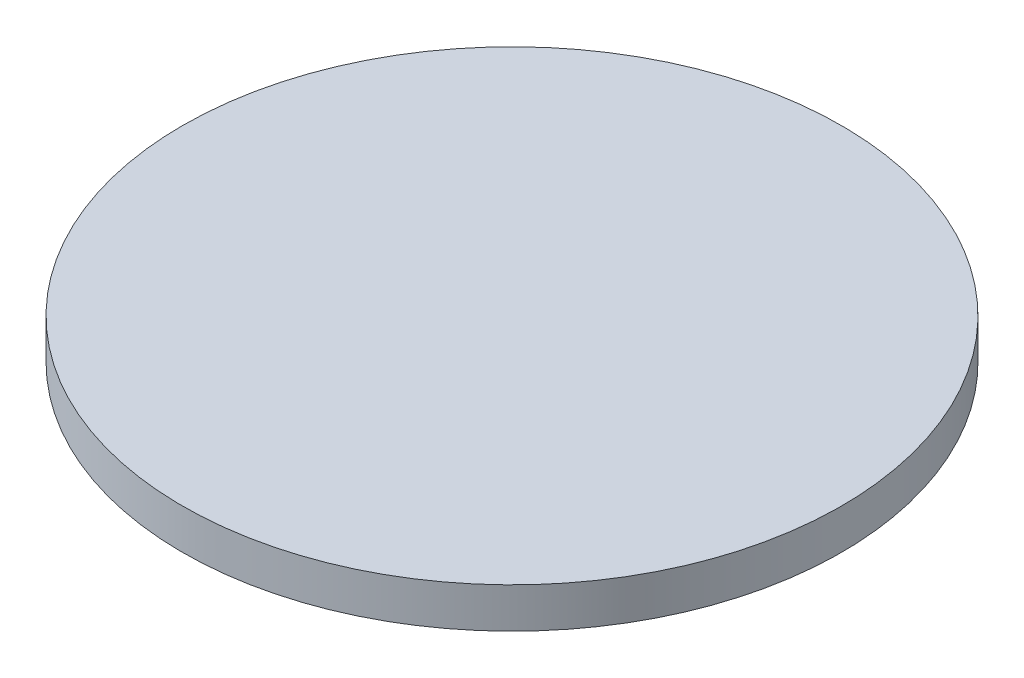
ISO-10303-21;
HEADER;
FILE_DESCRIPTION(('STEP AP214'),'2;1');
FILE_NAME('part.step','',(''),(''),'','','');
FILE_SCHEMA(('AUTOMOTIVE_DESIGN { 1 0 10303 214 1 1 1 1 }'));
ENDSEC;
DATA;
#1=APPLICATION_CONTEXT('core data for automotive mechanical design processes');
#2=APPLICATION_PROTOCOL_DEFINITION('international standard','automotive_design',2000,#1);
#3=PRODUCT_CONTEXT('',#1,'mechanical');
#4=PRODUCT('Part','Part','',(#3));
#5=PRODUCT_RELATED_PRODUCT_CATEGORY('part','',(#4));
#6=PRODUCT_DEFINITION_FORMATION('','',#4);
#7=PRODUCT_DEFINITION_CONTEXT('part definition',#1,'design');
#8=PRODUCT_DEFINITION('design','',#6,#7);
#9=PRODUCT_DEFINITION_SHAPE('','',#8);
#10=(LENGTH_UNIT() NAMED_UNIT(*) SI_UNIT(.MILLI.,.METRE.));
#11=(NAMED_UNIT(*) PLANE_ANGLE_UNIT() SI_UNIT($,.RADIAN.));
#12=(NAMED_UNIT(*) SI_UNIT($,.STERADIAN.) SOLID_ANGLE_UNIT());
#13=UNCERTAINTY_MEASURE_WITH_UNIT(LENGTH_MEASURE(1.E-05),#10,'distance_accuracy_value','');
#14=(GEOMETRIC_REPRESENTATION_CONTEXT(3) GLOBAL_UNCERTAINTY_ASSIGNED_CONTEXT((#13)) GLOBAL_UNIT_ASSIGNED_CONTEXT((#10,
#11,#12)) REPRESENTATION_CONTEXT('',''));
#15=CARTESIAN_POINT('',(0.,0.,0.));
#16=DIRECTION('',(0.,0.,1.));
#17=DIRECTION('',(1.,0.,0.));
#18=AXIS2_PLACEMENT_3D('',#15,#16,#17);
#19=CARTESIAN_POINT('',(-6.37017451861787,12.5735140888963,7.03200943644333));
#20=CARTESIAN_POINT('',(-6.37017451861787,12.5735140888963,6.52052571334626));
#21=CARTESIAN_POINT('',(-6.26942101925352,12.5735140888963,5.49755826715213));
#22=CARTESIAN_POINT('',(-5.82183812282996,12.5735140888963,4.02207519576666));
#23=CARTESIAN_POINT('',(-5.09500293873155,12.5735140888963,2.66226220925982));
#24=CARTESIAN_POINT('',(-4.11684733546933,12.5735140888963,1.47037615811117));
#25=CARTESIAN_POINT('',(-2.92496128432067,12.5735140888963,0.492220554848945));
#26=CARTESIAN_POINT('',(-1.56514829781384,12.5735140888963,-0.234614629249463));
#27=CARTESIAN_POINT('',(-0.089665226428362,12.5735140888963,-0.682197525673021));
#28=CARTESIAN_POINT('',(1.44478594286284,12.5735140888963,-0.833327774719554));
#29=CARTESIAN_POINT('',(2.97923711215404,12.5735140888963,-0.68219752567302));
#30=CARTESIAN_POINT('',(4.45472018353952,12.5735140888963,-0.234614629249463));
#31=CARTESIAN_POINT('',(5.81453317004635,12.5735140888963,0.492220554848944));
#32=CARTESIAN_POINT('',(7.00641922119501,12.5735140888963,1.47037615811117));
#33=CARTESIAN_POINT('',(7.98457482445723,12.5735140888963,2.66226220925982));
#34=CARTESIAN_POINT('',(8.71141000855564,12.5735140888963,4.02207519576666));
#35=CARTESIAN_POINT('',(9.1589929049792,12.5735140888963,5.49755826715213));
#36=CARTESIAN_POINT('',(9.31012315402573,12.5735140888963,7.03200943644333));
#37=CARTESIAN_POINT('',(9.1589929049792,12.5735140888963,8.56646060573454));
#38=CARTESIAN_POINT('',(8.71141000855564,12.5735140888963,10.04194367712));
#39=CARTESIAN_POINT('',(7.98457482445723,12.5735140888963,11.4017566636269));
#40=CARTESIAN_POINT('',(7.00641922119501,12.5735140888963,12.5936427147755));
#41=CARTESIAN_POINT('',(5.81453317004636,12.5735140888963,13.5717983180377));
#42=CARTESIAN_POINT('',(4.45472018353952,12.5735140888963,14.2986335021361));
#43=CARTESIAN_POINT('',(2.97923711215405,12.5735140888963,14.7462163985597));
#44=CARTESIAN_POINT('',(1.44478594286284,12.5735140888963,14.8973466476062));
#45=CARTESIAN_POINT('',(-0.0896652264283681,12.5735140888963,14.7462163985597));
#46=CARTESIAN_POINT('',(-1.56514829781383,12.5735140888963,14.2986335021361));
#47=CARTESIAN_POINT('',(-2.92496128432067,12.5735140888963,13.5717983180377));
#48=CARTESIAN_POINT('',(-4.11684733546933,12.5735140888963,12.5936427147755));
#49=CARTESIAN_POINT('',(-5.09500293873155,12.5735140888963,11.4017566636268));
#50=CARTESIAN_POINT('',(-5.82183812282996,12.5735140888963,10.04194367712));
#51=CARTESIAN_POINT('',(-6.26942101925351,12.5735140888963,8.56646060573455));
#52=CARTESIAN_POINT('',(-6.37017451861787,12.5735140888963,7.5434931595404));
#53=CARTESIAN_POINT('',(-6.37017451861787,12.5735140888963,7.03200943644333));
#54=B_SPLINE_CURVE_WITH_KNOTS('',3,(#19,#20,#21,#22,#23,#24,#25,#26,#27,#28,#29,#30,#31,#32,#33,
#34,#35,#36,#37,#38,#39,#40,#41,#42,#43,#44,#45,#46,#47,#48,#49,#50,#51,#52,#53),.UNSPECIFIED.,
.T.,.F.,(4,1,1,1,1,1,1,1,1,1,1,1,1,1,1,1,1,1,1,1,1,1,1,1,1,1,1,1,1,1,1,1,4),(0.,0.03125,0.0625,
0.09375,0.125,0.15625,0.1875,0.21875,0.25,0.28125,0.3125,0.34375,0.375,0.40625,0.4375,0.46875,
0.5,0.53125,0.5625,0.59375,0.625,0.65625,0.6875,0.71875,0.75,0.78125,0.8125,0.84375,0.875,
0.90625,0.9375,0.96875,1.),.UNSPECIFIED.);
#55=DIRECTION('',(0.,1.,0.));
#56=VECTOR('',#55,1.);
#57=SURFACE_OF_LINEAR_EXTRUSION('',#54,#56);
#58=CARTESIAN_POINT('',(-6.37017451861787,12.5735140888963,7.03200943644333));
#59=CARTESIAN_POINT('',(-6.37017449209452,12.5735140888963,7.15988115239138));
#60=CARTESIAN_POINT('',(-6.36702593416126,12.5735140888963,7.28775193770535));
#61=CARTESIAN_POINT('',(-6.3544620223688,12.5735140888963,7.54318638640623));
#62=CARTESIAN_POINT('',(-6.34504661983,12.5735140888963,7.67075004739975));
#63=CARTESIAN_POINT('',(-6.3199792866623,12.5735140888963,7.92526299069872));
#64=CARTESIAN_POINT('',(-6.3043273560334,12.5735140888963,8.05221227300417));
#65=CARTESIAN_POINT('',(-6.26681702571939,12.5735140888963,8.30518998250388));
#66=CARTESIAN_POINT('',(-6.24495867424601,12.5735140888963,8.43121841684353));
#67=CARTESIAN_POINT('',(-6.19506581513534,12.5735140888963,8.68204676199031));
#68=CARTESIAN_POINT('',(-6.16703130749805,12.5735140888963,8.80684667279746));
#69=CARTESIAN_POINT('',(-6.1048759488545,12.5735140888963,9.05492220074533));
#70=CARTESIAN_POINT('',(-6.07075505057191,12.5735140888963,9.178197806038));
#71=CARTESIAN_POINT('',(-5.9965163858844,12.5735140888963,9.42292988586721));
#72=CARTESIAN_POINT('',(-5.95639861947949,12.5735140888963,9.54438636040376));
#73=CARTESIAN_POINT('',(-5.87025553180646,12.5735140888963,9.78518529170162));
#74=CARTESIAN_POINT('',(-5.82423025642964,12.5735140888963,9.90452776487691));
#75=CARTESIAN_POINT('',(-5.72636189333866,12.5735140888963,10.1408028944036));
#76=CARTESIAN_POINT('',(-5.6745188056245,12.5735140888963,10.2577355507549));
#77=CARTESIAN_POINT('',(-5.565160609776,12.5735140888963,10.4889184694955));
#78=CARTESIAN_POINT('',(-5.50764545758517,12.5735140888963,10.6031687110411));
#79=CARTESIAN_POINT('',(-5.38708840785806,12.5735140888963,10.8287150871959));
#80=CARTESIAN_POINT('',(-5.32404651032177,12.5735140888963,10.9400112218052));
#81=CARTESIAN_POINT('',(-5.19258109684963,12.5735140888963,11.1593775865483));
#82=CARTESIAN_POINT('',(-5.12415762272105,12.5735140888963,11.2674478417337));
#83=CARTESIAN_POINT('',(-4.98207478168744,12.5735140888963,11.4800898404006));
#84=CARTESIAN_POINT('',(-4.90841541478241,12.5735140888963,11.5846615838821));
#85=CARTESIAN_POINT('',(-4.75605695593917,12.5735140888963,11.7900676620277));
#86=CARTESIAN_POINT('',(-4.67735782485738,12.5735140888963,11.8909019676537));
#87=CARTESIAN_POINT('',(-4.51511532988307,12.5735140888963,12.0885950197801));
#88=CARTESIAN_POINT('',(-4.43157196599054,12.5735140888963,12.1854537662805));
#89=CARTESIAN_POINT('',(-4.25983636883756,12.5735140888963,12.3749574379884));
#90=CARTESIAN_POINT('',(-4.17164417169376,12.5735140888963,12.4676023959223));
#91=CARTESIAN_POINT('',(-3.99080701661608,12.5735140888963,12.6484395509999));
#92=CARTESIAN_POINT('',(-3.8981620586822,12.5735140888963,12.7366317481437));
#93=CARTESIAN_POINT('',(-3.70865838697432,12.5735140888963,12.9083673452967));
#94=CARTESIAN_POINT('',(-3.61179964047393,12.5735140888963,12.9919107091892));
#95=CARTESIAN_POINT('',(-3.41410658834754,12.5735140888963,13.1541532041636));
#96=CARTESIAN_POINT('',(-3.31327228272154,12.5735140888963,13.2328523352453));
#97=CARTESIAN_POINT('',(-3.10786620457591,12.5735140888963,13.3852107940886));
#98=CARTESIAN_POINT('',(-3.00329446109436,12.5735140888963,13.4588701609936));
#99=CARTESIAN_POINT('',(-2.79065246242759,12.5735140888963,13.6009530020272));
#100=CARTESIAN_POINT('',(-2.68258220724237,12.5735140888963,13.6693764761558));
#101=CARTESIAN_POINT('',(-2.46321584249871,12.5735140888963,13.800841889628));
#102=CARTESIAN_POINT('',(-2.35191970788871,12.5735140888963,13.8638837871643));
#103=CARTESIAN_POINT('',(-2.12637333173592,12.5735140888963,13.9844408368913));
#104=CARTESIAN_POINT('',(-2.01212309019312,12.5735140888963,14.041955989082));
#105=CARTESIAN_POINT('',(-1.78094017144492,12.5735140888963,14.1513141849309));
#106=CARTESIAN_POINT('',(-1.66400751508311,12.5735140888963,14.2031572726455));
#107=CARTESIAN_POINT('',(-1.42773238558501,12.5735140888963,14.3010256357351));
#108=CARTESIAN_POINT('',(-1.30838991244872,12.5735140888963,14.34705091111));
#109=CARTESIAN_POINT('',(-1.0675909810443,12.5735140888963,14.4331939987883));
#110=CARTESIAN_POINT('',(-0.946134506362177,12.5735140888963,14.4733117652004));
#111=CARTESIAN_POINT('',(-0.701402426930673,12.5735140888963,14.5475504298683));
#112=CARTESIAN_POINT('',(-0.578126822181295,12.5735140888963,14.581671328124));
#113=CARTESIAN_POINT('',(-0.330051292749144,12.5735140888963,14.6438266868409));
#114=CARTESIAN_POINT('',(-0.205251379914463,12.5735140888963,14.6718611945782));
#115=CARTESIAN_POINT('',(0.0455769596929786,12.5735140888963,14.7217540534155));
#116=CARTESIAN_POINT('',(0.171605386465739,12.5735140888963,14.7436124045153));
#117=CARTESIAN_POINT('',(0.42458311663864,12.5735140888963,14.7811227358498));
#118=CARTESIAN_POINT('',(0.551532427184443,12.5735140888963,14.7967746678728));
#119=CARTESIAN_POINT('',(0.80604529332944,12.5735140888963,14.8218419972319));
#120=CARTESIAN_POINT('',(0.933608848928636,12.5735140888963,14.831257394568));
#121=CARTESIAN_POINT('',(1.18904358557102,12.5735140888963,14.8438213205744));
#122=CARTESIAN_POINT('',(1.31691476421693,12.5735140888963,14.846969897924));
#123=CARTESIAN_POINT('',(1.57265712150875,12.5735140888963,14.846969897924));
#124=CARTESIAN_POINT('',(1.70052830015466,12.5735140888963,14.8438213205744));
#125=CARTESIAN_POINT('',(1.95596303679705,12.5735140888963,14.831257394568));
#126=CARTESIAN_POINT('',(2.08352659239624,12.5735140888963,14.8218419972319));
#127=CARTESIAN_POINT('',(2.33803945854124,12.5735140888963,14.7967746678728));
#128=CARTESIAN_POINT('',(2.46498876908704,12.5735140888963,14.7811227358498));
#129=CARTESIAN_POINT('',(2.71796649925994,12.5735140888963,14.7436124045153));
#130=CARTESIAN_POINT('',(2.8439949260327,12.5735140888963,14.7217540534155));
#131=CARTESIAN_POINT('',(3.09482326564015,12.5735140888963,14.6718611945782));
#132=CARTESIAN_POINT('',(3.21962317847483,12.5735140888963,14.6438266868409));
#133=CARTESIAN_POINT('',(3.46769870790698,12.5735140888963,14.581671328124));
#134=CARTESIAN_POINT('',(3.59097431265636,12.5735140888963,14.5475504298683));
#135=CARTESIAN_POINT('',(3.83570639208786,12.5735140888963,14.4733117652004));
#136=CARTESIAN_POINT('',(3.95716286676999,12.5735140888963,14.4331939987883));
#137=CARTESIAN_POINT('',(4.19796179817441,12.5735140888963,14.34705091111));
#138=CARTESIAN_POINT('',(4.3173042713107,12.5735140888963,14.3010256357351));
#139=CARTESIAN_POINT('',(4.5535794008088,12.5735140888963,14.2031572726455));
#140=CARTESIAN_POINT('',(4.67051205717061,12.5735140888963,14.1513141849309));
#141=CARTESIAN_POINT('',(4.90169497591882,12.5735140888963,14.041955989082));
#142=CARTESIAN_POINT('',(5.01594521746161,12.5735140888963,13.9844408368913));
#143=CARTESIAN_POINT('',(5.2414915936144,12.5735140888963,13.8638837871643));
#144=CARTESIAN_POINT('',(5.3527877282244,12.5735140888963,13.800841889628));
#145=CARTESIAN_POINT('',(5.57215409296806,12.5735140888963,13.6693764761558));
#146=CARTESIAN_POINT('',(5.68022434815328,12.5735140888963,13.6009530020272));
#147=CARTESIAN_POINT('',(5.89286634682005,12.5735140888963,13.4588701609936));
#148=CARTESIAN_POINT('',(5.99743809030159,12.5735140888963,13.3852107940886));
#149=CARTESIAN_POINT('',(6.20284416844723,12.5735140888963,13.2328523352453));
#150=CARTESIAN_POINT('',(6.30367847407323,12.5735140888963,13.1541532041636));
#151=CARTESIAN_POINT('',(6.50137152619962,12.5735140888963,12.9919107091892));
#152=CARTESIAN_POINT('',(6.5982302727,12.5735140888963,12.9083673452967));
#153=CARTESIAN_POINT('',(6.78773394440788,12.5735140888963,12.7366317481437));
#154=CARTESIAN_POINT('',(6.88037890234176,12.5735140888963,12.6484395509999));
#155=CARTESIAN_POINT('',(7.06121605741944,12.5735140888963,12.4676023959223));
#156=CARTESIAN_POINT('',(7.14940825456324,12.5735140888963,12.3749574379884));
#157=CARTESIAN_POINT('',(7.32114385171622,12.5735140888963,12.1854537662805));
#158=CARTESIAN_POINT('',(7.40468721560875,12.5735140888963,12.0885950197801));
#159=CARTESIAN_POINT('',(7.56692971058306,12.5735140888963,11.8909019676537));
#160=CARTESIAN_POINT('',(7.64562884166485,12.5735140888963,11.7900676620277));
#161=CARTESIAN_POINT('',(7.79798730050809,12.5735140888963,11.5846615838821));
#162=CARTESIAN_POINT('',(7.87164666741313,12.5735140888963,11.4800898404005));
#163=CARTESIAN_POINT('',(8.01372950844673,12.5735140888963,11.2674478417338));
#164=CARTESIAN_POINT('',(8.08215298257529,12.5735140888963,11.1593775865485));
#165=CARTESIAN_POINT('',(8.21361839604747,12.5735140888963,10.9400112218049));
#166=CARTESIAN_POINT('',(8.27666029358379,12.5735140888963,10.8287150871949));
#167=CARTESIAN_POINT('',(8.3972173433108,12.5735140888963,10.6031687110421));
#168=CARTESIAN_POINT('',(8.45473249550149,12.5735140888963,10.4889184694993));
#169=CARTESIAN_POINT('',(8.56409069135037,12.5735140888963,10.2577355507511));
#170=CARTESIAN_POINT('',(8.61593377906504,12.5735140888963,10.1408028943893));
#171=CARTESIAN_POINT('',(8.71380214215462,12.5735140888963,9.90452776489119));
#172=CARTESIAN_POINT('',(8.75982741752952,12.5735140888963,9.7851852917549));
#173=CARTESIAN_POINT('',(8.8459705052078,12.5735140888963,9.54438636035048));
#174=CARTESIAN_POINT('',(8.8860882716199,12.5735140888963,9.42292988566835));
#175=CARTESIAN_POINT('',(8.96032693628778,12.5735140888963,9.17819780623685));
#176=CARTESIAN_POINT('',(8.99444783454355,12.5735140888963,9.05492220148747));
#177=CARTESIAN_POINT('',(9.05660319326037,12.5735140888963,8.80684667205532));
#178=CARTESIAN_POINT('',(9.08463770099775,12.5735140888963,8.68204675922064));
#179=CARTESIAN_POINT('',(9.13453055983497,12.5735140888963,8.4312184196132));
#180=CARTESIAN_POINT('',(9.15638891093482,12.5735140888963,8.30518999284044));
#181=CARTESIAN_POINT('',(9.19389924226934,12.5735140888963,8.05221226266754));
#182=CARTESIAN_POINT('',(9.2095511742923,12.5735140888963,7.92526295212173));
#183=CARTESIAN_POINT('',(9.23461850365137,12.5735140888963,7.67075008597674));
#184=CARTESIAN_POINT('',(9.24403390098749,12.5735140888963,7.54318653037754));
#185=CARTESIAN_POINT('',(9.25659782699388,12.5735140888963,7.28775179373516));
#186=CARTESIAN_POINT('',(9.25974640434355,12.5735140888963,7.15988061508924));
#187=CARTESIAN_POINT('',(9.25974640434355,12.5735140888963,6.90413825779742));
#188=CARTESIAN_POINT('',(9.25659782699388,12.5735140888963,6.77626707915151));
#189=CARTESIAN_POINT('',(9.24403390098749,12.5735140888963,6.52083234250913));
#190=CARTESIAN_POINT('',(9.23461850365137,12.5735140888963,6.39326878690993));
#191=CARTESIAN_POINT('',(9.2095511742923,12.5735140888963,6.13875592076494));
#192=CARTESIAN_POINT('',(9.19389924226934,12.5735140888963,6.01180661021913));
#193=CARTESIAN_POINT('',(9.15638891093482,12.5735140888963,5.75882888004623));
#194=CARTESIAN_POINT('',(9.13453055983497,12.5735140888963,5.63280045327347));
#195=CARTESIAN_POINT('',(9.08463770099775,12.5735140888963,5.38197211366603));
#196=CARTESIAN_POINT('',(9.05660319326037,12.5735140888963,5.25717220083135));
#197=CARTESIAN_POINT('',(8.99444783454355,12.5735140888963,5.0090966713992));
#198=CARTESIAN_POINT('',(8.96032693628778,12.5735140888963,4.88582106664982));
#199=CARTESIAN_POINT('',(8.8860882716199,12.5735140888963,4.64108898721831));
#200=CARTESIAN_POINT('',(8.8459705052078,12.5735140888963,4.51963251253619));
#201=CARTESIAN_POINT('',(8.75982741752952,12.5735140888963,4.27883358113177));
#202=CARTESIAN_POINT('',(8.71380214215461,12.5735140888963,4.15949110799548));
#203=CARTESIAN_POINT('',(8.61593377906504,12.5735140888963,3.92321597849738));
#204=CARTESIAN_POINT('',(8.56409069135037,12.5735140888963,3.80628332213556));
#205=CARTESIAN_POINT('',(8.45473249550149,12.5735140888963,3.57510040338736));
#206=CARTESIAN_POINT('',(8.3972173433108,12.5735140888963,3.46085016184457));
#207=CARTESIAN_POINT('',(8.27666029358378,12.5735140888963,3.23530378569178));
#208=CARTESIAN_POINT('',(8.21361839604747,12.5735140888963,3.12400765108178));
#209=CARTESIAN_POINT('',(8.08215298257529,12.5735140888963,2.90464128633812));
#210=CARTESIAN_POINT('',(8.01372950844672,12.5735140888963,2.7965710311529));
#211=CARTESIAN_POINT('',(7.87164666741313,12.5735140888963,2.58392903248613));
#212=CARTESIAN_POINT('',(7.79798730050809,12.5735140888963,2.47935728900458));
#213=CARTESIAN_POINT('',(7.64562884166485,12.5735140888963,2.27395121085895));
#214=CARTESIAN_POINT('',(7.56692971058306,12.5735140888963,2.17311690523295));
#215=CARTESIAN_POINT('',(7.40468721560875,12.5735140888963,1.97542385310656));
#216=CARTESIAN_POINT('',(7.32114385171622,12.5735140888963,1.87856510660617));
#217=CARTESIAN_POINT('',(7.14940825456324,12.5735140888963,1.68906143489829));
#218=CARTESIAN_POINT('',(7.06121605741944,12.5735140888963,1.59641647696441));
#219=CARTESIAN_POINT('',(6.88037890234176,12.5735140888963,1.41557932188673));
#220=CARTESIAN_POINT('',(6.78773394440788,12.5735140888963,1.32738712474293));
#221=CARTESIAN_POINT('',(6.5982302727,12.5735140888963,1.15565152758995));
#222=CARTESIAN_POINT('',(6.50137152619961,12.5735140888963,1.07210816369743));
#223=CARTESIAN_POINT('',(6.30367847407322,12.5735140888963,0.909865668723112));
#224=CARTESIAN_POINT('',(6.20284416844722,12.5735140888963,0.831166537641325));
#225=CARTESIAN_POINT('',(5.99743809030159,12.5735140888963,0.678808078798079));
#226=CARTESIAN_POINT('',(5.89286634682004,12.5735140888963,0.605148711893046));
#227=CARTESIAN_POINT('',(5.68022434815327,12.5735140888963,0.463065870859447));
#228=CARTESIAN_POINT('',(5.57215409296805,12.5735140888963,0.394642396730881));
#229=CARTESIAN_POINT('',(5.35278772822439,12.5735140888963,0.263176983258706));
#230=CARTESIAN_POINT('',(5.2414915936144,12.5735140888963,0.200135085722386));
#231=CARTESIAN_POINT('',(5.01594521746161,12.5735140888963,0.0795780359953731));
#232=CARTESIAN_POINT('',(4.90169497591881,12.5735140888963,0.0220628838046807));
#233=CARTESIAN_POINT('',(4.67051205717061,12.5735140888963,-0.0872953120441946));
#234=CARTESIAN_POINT('',(4.5535794008088,12.5735140888963,-0.139138399758868));
#235=CARTESIAN_POINT('',(4.31730427131069,12.5735140888963,-0.237006762848441));
#236=CARTESIAN_POINT('',(4.1979617981744,12.5735140888963,-0.28303203822334));
#237=CARTESIAN_POINT('',(3.95716286676999,12.5735140888963,-0.369175125901625));
#238=CARTESIAN_POINT('',(3.83570639208786,12.5735140888963,-0.409292892313723));
#239=CARTESIAN_POINT('',(3.59097431265635,12.5735140888963,-0.483531556981599));
#240=CARTESIAN_POINT('',(3.46769870790698,12.5735140888963,-0.517652455237377));
#241=CARTESIAN_POINT('',(3.21962317847482,12.5735140888963,-0.579807813954193));
#242=CARTESIAN_POINT('',(3.09482326564014,12.5735140888963,-0.607842321691571));
#243=CARTESIAN_POINT('',(2.8439949260327,12.5735140888963,-0.657735180528796));
#244=CARTESIAN_POINT('',(2.71796649925994,12.5735140888963,-0.679593531628642));
#245=CARTESIAN_POINT('',(2.46498876908704,12.5735140888963,-0.717103862963162));
#246=CARTESIAN_POINT('',(2.33803945854124,12.5735140888963,-0.732755794986123));
#247=CARTESIAN_POINT('',(2.08352659239624,12.5735140888963,-0.757823124345198));
#248=CARTESIAN_POINT('',(1.95596303679704,12.5735140888963,-0.767238521681312));
#249=CARTESIAN_POINT('',(1.70052830015466,12.5735140888963,-0.779802447687708));
#250=CARTESIAN_POINT('',(1.57265712150875,12.5735140888963,-0.782951025037376));
#251=CARTESIAN_POINT('',(1.31691476421693,12.5735140888963,-0.782951025037376));
#252=CARTESIAN_POINT('',(1.18904358557102,12.5735140888963,-0.779802447687708));
#253=CARTESIAN_POINT('',(0.933608848928633,12.5735140888963,-0.767238521681312));
#254=CARTESIAN_POINT('',(0.806045293329438,12.5735140888963,-0.757823124345198));
#255=CARTESIAN_POINT('',(0.551532427184441,12.5735140888963,-0.732755794986123));
#256=CARTESIAN_POINT('',(0.424583116638639,12.5735140888963,-0.717103862963162));
#257=CARTESIAN_POINT('',(0.171605386465739,12.5735140888963,-0.679593531628643));
#258=CARTESIAN_POINT('',(0.0455769596929784,12.5735140888963,-0.657735180528796));
#259=CARTESIAN_POINT('',(-0.205251379914463,12.5735140888963,-0.607842321691571));
#260=CARTESIAN_POINT('',(-0.330051292749145,12.5735140888963,-0.579807813954192));
#261=CARTESIAN_POINT('',(-0.578126822181296,12.5735140888963,-0.517652455237377));
#262=CARTESIAN_POINT('',(-0.701402426930674,12.5735140888963,-0.483531556981599));
#263=CARTESIAN_POINT('',(-0.946134506362179,12.5735140888963,-0.409292892313723));
#264=CARTESIAN_POINT('',(-1.06759098104431,12.5735140888963,-0.369175125901626));
#265=CARTESIAN_POINT('',(-1.30838991244873,12.5735140888963,-0.28303203822334));
#266=CARTESIAN_POINT('',(-1.42773238558501,12.5735140888963,-0.237006762848441));
#267=CARTESIAN_POINT('',(-1.66400751508312,12.5735140888963,-0.139138399758868));
#268=CARTESIAN_POINT('',(-1.78094017144493,12.5735140888963,-0.0872953120441942));
#269=CARTESIAN_POINT('',(-2.01212309019313,12.5735140888963,0.0220628838046812));
#270=CARTESIAN_POINT('',(-2.12637333173593,12.5735140888963,0.0795780359953735));
#271=CARTESIAN_POINT('',(-2.35191970788872,12.5735140888963,0.200135085722386));
#272=CARTESIAN_POINT('',(-2.46321584249871,12.5735140888963,0.263176983258707));
#273=CARTESIAN_POINT('',(-2.68258220724237,12.5735140888963,0.394642396730882));
#274=CARTESIAN_POINT('',(-2.79065246242759,12.5735140888963,0.463065870859448));
#275=CARTESIAN_POINT('',(-3.00329446109436,12.5735140888963,0.605148711893047));
#276=CARTESIAN_POINT('',(-3.10786620457591,12.5735140888963,0.67880807879808));
#277=CARTESIAN_POINT('',(-3.31327228272154,12.5735140888963,0.831166537641326));
#278=CARTESIAN_POINT('',(-3.41410658834754,12.5735140888963,0.909865668723113));
#279=CARTESIAN_POINT('',(-3.61179964047393,12.5735140888963,1.07210816369743));
#280=CARTESIAN_POINT('',(-3.70865838697432,12.5735140888963,1.15565152758995));
#281=CARTESIAN_POINT('',(-3.8981620586822,12.5735140888963,1.32738712474293));
#282=CARTESIAN_POINT('',(-3.99080701661608,12.5735140888963,1.41557932188673));
#283=CARTESIAN_POINT('',(-4.17164417169376,12.5735140888963,1.59641647696441));
#284=CARTESIAN_POINT('',(-4.25983636883756,12.5735140888963,1.68906143489829));
#285=CARTESIAN_POINT('',(-4.43157196599054,12.5735140888963,1.87856510660617));
#286=CARTESIAN_POINT('',(-4.51511532988307,12.5735140888963,1.97542385310656));
#287=CARTESIAN_POINT('',(-4.67735782485738,12.5735140888963,2.17311690523296));
#288=CARTESIAN_POINT('',(-4.75605695593917,12.5735140888963,2.27395121085897));
#289=CARTESIAN_POINT('',(-4.90841541478241,12.5735140888963,2.47935728900456));
#290=CARTESIAN_POINT('',(-4.98207478168744,12.5735140888963,2.58392903248606));
#291=CARTESIAN_POINT('',(-5.12415762272105,12.5735140888963,2.79657103115298));
#292=CARTESIAN_POINT('',(-5.19258109684963,12.5735140888963,2.9046412863384));
#293=CARTESIAN_POINT('',(-5.32404651032177,12.5735140888963,3.12400765108151));
#294=CARTESIAN_POINT('',(-5.38708840785806,12.5735140888963,3.23530378569075));
#295=CARTESIAN_POINT('',(-5.50764545758517,12.5735140888963,3.46085016184559));
#296=CARTESIAN_POINT('',(-5.565160609776,12.5735140888963,3.57510040339119));
#297=CARTESIAN_POINT('',(-5.6745188056245,12.5735140888963,3.80628332213174));
#298=CARTESIAN_POINT('',(-5.72636189333866,12.5735140888963,3.9232159784831));
#299=CARTESIAN_POINT('',(-5.82423025642964,12.5735140888963,4.15949110800976));
#300=CARTESIAN_POINT('',(-5.87025553180646,12.5735140888963,4.27883358118505));
#301=CARTESIAN_POINT('',(-5.95639861947949,12.5735140888963,4.51963251248291));
#302=CARTESIAN_POINT('',(-5.9965163858844,12.5735140888963,4.64108898701946));
#303=CARTESIAN_POINT('',(-6.07075505057191,12.5735140888963,4.88582106684868));
#304=CARTESIAN_POINT('',(-6.10487594885451,12.5735140888963,5.00909667214134));
#305=CARTESIAN_POINT('',(-6.16703130749805,12.5735140888963,5.25717220008922));
#306=CARTESIAN_POINT('',(-6.19506581513534,12.5735140888963,5.38197211089636));
#307=CARTESIAN_POINT('',(-6.24495867424601,12.5735140888963,5.63280045604315));
#308=CARTESIAN_POINT('',(-6.26681702571939,12.5735140888963,5.75882889038279));
#309=CARTESIAN_POINT('',(-6.3043273560334,12.5735140888963,6.0118065998825));
#310=CARTESIAN_POINT('',(-6.3199792866623,12.5735140888963,6.13875588218795));
#311=CARTESIAN_POINT('',(-6.34504661983,12.5735140888963,6.39326882548692));
#312=CARTESIAN_POINT('',(-6.3544620223688,12.5735140888963,6.52083248648044));
#313=CARTESIAN_POINT('',(-6.36702593416127,12.5735140888963,6.77626693518132));
#314=CARTESIAN_POINT('',(-6.37017449209452,12.5735140888963,6.90413772049529));
#315=CARTESIAN_POINT('',(-6.37017451861787,12.5735140888963,7.03200943644333));
#316=B_SPLINE_CURVE_WITH_KNOTS('',3,(#58,#59,#60,#61,#62,#63,#64,#65,#66,#67,#68,#69,#70,#71,
#72,#73,#74,#75,#76,#77,#78,#79,#80,#81,#82,#83,#84,#85,#86,#87,#88,#89,#90,#91,#92,#93,#94,#95,
#96,#97,#98,#99,#100,#101,#102,#103,#104,#105,#106,#107,#108,#109,#110,#111,#112,#113,#114,#115,
#116,#117,#118,#119,#120,#121,#122,#123,#124,#125,#126,#127,#128,#129,#130,#131,#132,#133,#134,
#135,#136,#137,#138,#139,#140,#141,#142,#143,#144,#145,#146,#147,#148,#149,#150,#151,#152,#153,
#154,#155,#156,#157,#158,#159,#160,#161,#162,#163,#164,#165,#166,#167,#168,#169,#170,#171,#172,
#173,#174,#175,#176,#177,#178,#179,#180,#181,#182,#183,#184,#185,#186,#187,#188,#189,#190,#191,
#192,#193,#194,#195,#196,#197,#198,#199,#200,#201,#202,#203,#204,#205,#206,#207,#208,#209,#210,
#211,#212,#213,#214,#215,#216,#217,#218,#219,#220,#221,#222,#223,#224,#225,#226,#227,#228,#229,
#230,#231,#232,#233,#234,#235,#236,#237,#238,#239,#240,#241,#242,#243,#244,#245,#246,#247,#248,
#249,#250,#251,#252,#253,#254,#255,#256,#257,#258,#259,#260,#261,#262,#263,#264,#265,#266,#267,
#268,#269,#270,#271,#272,#273,#274,#275,#276,#277,#278,#279,#280,#281,#282,#283,#284,#285,#286,
#287,#288,#289,#290,#291,#292,#293,#294,#295,#296,#297,#298,#299,#300,#301,#302,#303,#304,#305,
#306,#307,#308,#309,#310,#311,#312,#313,#314,#315),.UNSPECIFIED.,.F.,.F.,(4,2,2,2,2,2,2,2,2,2,2,
2,2,2,2,2,2,2,2,2,2,2,2,2,2,2,2,2,2,2,2,2,2,2,2,2,2,2,2,2,2,2,2,2,2,2,2,2,2,2,2,2,2,2,2,2,2,2,2,
2,2,2,2,2,2,2,2,2,2,2,2,2,2,2,2,2,2,2,2,2,2,2,2,2,2,2,2,2,2,2,2,2,2,2,2,2,2,2,2,2,2,2,2,2,2,2,2,
2,2,2,2,2,2,2,2,2,2,2,2,2,2,2,2,2,2,2,2,2,4),(0.,0.383575175646083,0.767153330861139,
1.15073148607619,1.53430666172228,1.91788183736836,2.30145999258341,2.68503814779847,
3.06861332344455,3.45218849909063,3.83576665430568,4.21934480952074,4.60291998516682,
4.9864951608129,5.37007331602796,5.75365147124301,6.1372266468891,6.52080182253518,
6.90437997775023,7.28795813296529,7.67153330861137,8.05510848425745,8.43868663947251,
8.82226479468756,9.20583997033364,9.58941514597972,9.97299330119477,10.3565714564098,
10.7401466320559,11.123721807702,11.507299962917,11.8908781181321,12.2744532937782,
12.6580284694243,13.0416066246393,13.4251847798544,13.8087599555005,14.1923351311465,
14.5759132863616,14.9594914415767,15.3430666172227,15.7266417928688,16.1102199480839,
16.4937981032989,16.877373278945,17.2609484545911,17.6445266098061,18.0281047650212,
18.4116799406673,18.7952551163134,19.1788332715284,19.5624114267435,19.9459866023895,
20.3295617780356,20.7131399332507,21.0967180884657,21.4802932641118,21.8638684397579,
22.247446594973,22.631024750188,23.0145999258341,23.3981751014802,23.7817532566952,
24.1653314119103,24.5489065875564,24.9324817632025,25.3160599184175,25.6996380736326,
26.0832132492786,26.4667884249247,26.8503665801398,27.2339447353548,27.6175199110009,
28.001095086647,28.3846732418621,28.7682513970771,29.1518265727232,29.5354017483693,
29.9189799035843,30.3025580587994,30.6861332344455,31.0697084100915,31.4532865653066,
31.8368647205217,32.2204398961677,32.6040150718138,32.9875932270289,33.3711713822439,
33.75474655789,34.1383217335361,34.5218998887511,34.9054780439662,35.2890532196123,
35.6726283952584,36.0562065504734,36.4397847056885,36.8233598813346,37.2069350569806,
37.5905132121957,37.9740913674107,38.3576665430568,38.7412417187029,39.124819873918,
39.508398029133,39.8919732047791,40.2755483804252,40.6591265356402,41.0427046908553,
41.4262798665014,41.8098550421474,42.1934331973625,42.5770113525776,42.9605865282236,
43.3441617038697,43.7277398590848,44.1113180142998,44.4948931899459,44.878468365592,
45.262046520807,45.6456246760221,46.0291998516682,46.4127750273143,46.7963531825293,
47.1799313377444,47.5635065133905,47.9470816890365,48.3306598442516,48.7142379994666,
49.0978131751127),.UNSPECIFIED.);
#317=CARTESIAN_POINT('',(-6.37017451861787,12.5735140888963,7.03200943644333));
#318=VERTEX_POINT('',#317);
#319=EDGE_CURVE('E9',#318,#318,#316,.F.);
#320=ORIENTED_EDGE('',*,*,#319,.F.);
#321=EDGE_LOOP('',(#320));
#322=FACE_BOUND('',#321,.T.);
#323=CARTESIAN_POINT('',(-6.37017451861787,13.5262702217476,7.03200943644333));
#324=CARTESIAN_POINT('',(-6.37017451861787,13.5262702217476,6.52052571334626));
#325=CARTESIAN_POINT('',(-6.26942101925352,13.5262702217476,5.49755826715213));
#326=CARTESIAN_POINT('',(-5.82183812282996,13.5262702217476,4.02207519576666));
#327=CARTESIAN_POINT('',(-5.09500293873155,13.5262702217476,2.66226220925982));
#328=CARTESIAN_POINT('',(-4.11684733546933,13.5262702217476,1.47037615811117));
#329=CARTESIAN_POINT('',(-2.92496128432067,13.5262702217476,0.492220554848945));
#330=CARTESIAN_POINT('',(-1.56514829781384,13.5262702217476,-0.234614629249463));
#331=CARTESIAN_POINT('',(-0.0896652264283621,13.5262702217476,-0.682197525673021));
#332=CARTESIAN_POINT('',(1.44478594286284,13.5262702217476,-0.833327774719554));
#333=CARTESIAN_POINT('',(2.97923711215404,13.5262702217476,-0.68219752567302));
#334=CARTESIAN_POINT('',(4.45472018353952,13.5262702217476,-0.234614629249463));
#335=CARTESIAN_POINT('',(5.81453317004635,13.5262702217476,0.492220554848944));
#336=CARTESIAN_POINT('',(7.00641922119501,13.5262702217476,1.47037615811117));
#337=CARTESIAN_POINT('',(7.98457482445723,13.5262702217476,2.66226220925982));
#338=CARTESIAN_POINT('',(8.71141000855564,13.5262702217476,4.02207519576666));
#339=CARTESIAN_POINT('',(9.1589929049792,13.5262702217476,5.49755826715213));
#340=CARTESIAN_POINT('',(9.31012315402573,13.5262702217476,7.03200943644333));
#341=CARTESIAN_POINT('',(9.1589929049792,13.5262702217476,8.56646060573454));
#342=CARTESIAN_POINT('',(8.71141000855564,13.5262702217476,10.04194367712));
#343=CARTESIAN_POINT('',(7.98457482445723,13.5262702217476,11.4017566636269));
#344=CARTESIAN_POINT('',(7.00641922119501,13.5262702217476,12.5936427147755));
#345=CARTESIAN_POINT('',(5.81453317004636,13.5262702217476,13.5717983180377));
#346=CARTESIAN_POINT('',(4.45472018353952,13.5262702217476,14.2986335021361));
#347=CARTESIAN_POINT('',(2.97923711215405,13.5262702217476,14.7462163985597));
#348=CARTESIAN_POINT('',(1.44478594286284,13.5262702217476,14.8973466476062));
#349=CARTESIAN_POINT('',(-0.0896652264283682,13.5262702217476,14.7462163985597));
#350=CARTESIAN_POINT('',(-1.56514829781383,13.5262702217476,14.2986335021361));
#351=CARTESIAN_POINT('',(-2.92496128432067,13.5262702217476,13.5717983180377));
#352=CARTESIAN_POINT('',(-4.11684733546933,13.5262702217476,12.5936427147755));
#353=CARTESIAN_POINT('',(-5.09500293873155,13.5262702217476,11.4017566636268));
#354=CARTESIAN_POINT('',(-5.82183812282996,13.5262702217476,10.04194367712));
#355=CARTESIAN_POINT('',(-6.26942101925351,13.5262702217476,8.56646060573455));
#356=CARTESIAN_POINT('',(-6.37017451861787,13.5262702217476,7.5434931595404));
#357=CARTESIAN_POINT('',(-6.37017451861787,13.5262702217476,7.03200943644333));
#358=B_SPLINE_CURVE_WITH_KNOTS('',3,(#323,#324,#325,#326,#327,#328,#329,#330,#331,#332,#333,
#334,#335,#336,#337,#338,#339,#340,#341,#342,#343,#344,#345,#346,#347,#348,#349,#350,#351,#352,
#353,#354,#355,#356,#357),.UNSPECIFIED.,.T.,.F.,(4,1,1,1,1,1,1,1,1,1,1,1,1,1,1,1,1,1,1,1,1,1,1,
1,1,1,1,1,1,1,1,1,4),(0.,0.03125,0.0625,0.09375,0.125,0.15625,0.1875,0.21875,0.25,0.28125,
0.3125,0.34375,0.375,0.40625,0.4375,0.46875,0.5,0.53125,0.5625,0.59375,0.625,0.65625,0.6875,
0.71875,0.75,0.78125,0.8125,0.84375,0.875,0.90625,0.9375,0.96875,1.),.UNSPECIFIED.);
#359=CARTESIAN_POINT('',(-6.37017451861787,13.5262702217476,7.03200943644333));
#360=VERTEX_POINT('',#359);
#361=EDGE_CURVE('E24',#360,#360,#358,.T.);
#362=ORIENTED_EDGE('',*,*,#361,.T.);
#363=EDGE_LOOP('',(#362));
#364=FACE_BOUND('',#363,.T.);
#365=ADVANCED_FACE('F14',(#322,#364),#57,.F.);
#366=CARTESIAN_POINT('',(-5.96956141810716,12.5735140888963,5.36244266303257));
#367=DIRECTION('',(0.,1.,0.));
#368=DIRECTION('',(-1.,0.,0.));
#369=AXIS2_PLACEMENT_3D('',#366,#367,#368);
#370=PLANE('',#369);
#371=ORIENTED_EDGE('',*,*,#319,.T.);
#372=EDGE_LOOP('',(#371));
#373=FACE_BOUND('',#372,.T.);
#374=ADVANCED_FACE('F59',(#373),#370,.F.);
#375=CARTESIAN_POINT('',(-5.96956141810716,13.5262702217476,5.36244266303257));
#376=DIRECTION('',(0.,1.,0.));
#377=DIRECTION('',(-1.,0.,0.));
#378=AXIS2_PLACEMENT_3D('',#375,#376,#377);
#379=PLANE('',#378);
#380=ORIENTED_EDGE('',*,*,#361,.F.);
#381=EDGE_LOOP('',(#380));
#382=FACE_BOUND('',#381,.T.);
#383=ADVANCED_FACE('F67',(#382),#379,.T.);
#384=CLOSED_SHELL('',(#365,#374,#383));
#385=MANIFOLD_SOLID_BREP('B1',#384);
#386=ADVANCED_BREP_SHAPE_REPRESENTATION('',(#18,#385),#14);
#387=SHAPE_DEFINITION_REPRESENTATION(#9,#386);
ENDSEC;
END-ISO-10303-21;
